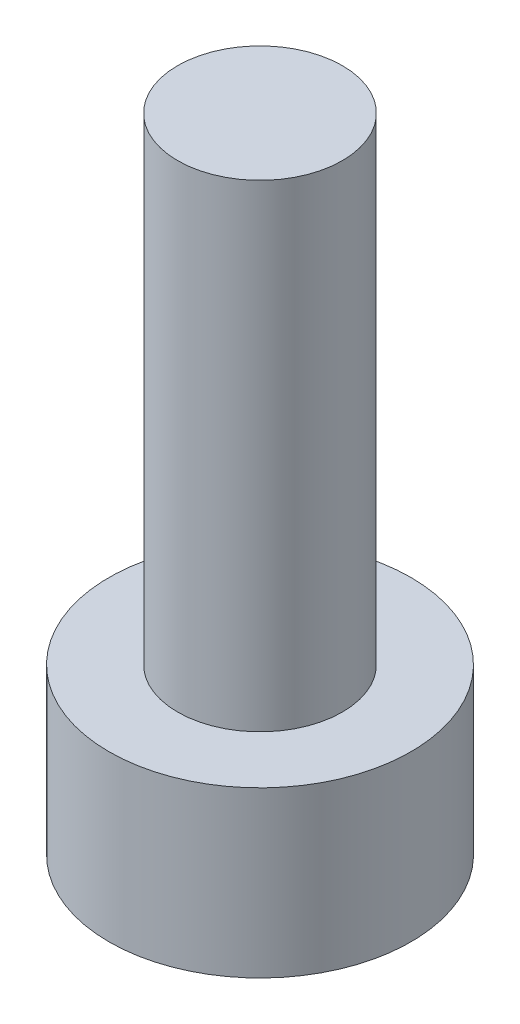
ISO-10303-21;
HEADER;
FILE_DESCRIPTION(('STEP AP214'),'2;1');
FILE_NAME('part.step','',(''),(''),'','','');
FILE_SCHEMA(('AUTOMOTIVE_DESIGN { 1 0 10303 214 1 1 1 1 }'));
ENDSEC;
DATA;
#1=APPLICATION_CONTEXT('core data for automotive mechanical design processes');
#2=APPLICATION_PROTOCOL_DEFINITION('international standard','automotive_design',2000,#1);
#3=PRODUCT_CONTEXT('',#1,'mechanical');
#4=PRODUCT('Part','Part','',(#3));
#5=PRODUCT_RELATED_PRODUCT_CATEGORY('part','',(#4));
#6=PRODUCT_DEFINITION_FORMATION('','',#4);
#7=PRODUCT_DEFINITION_CONTEXT('part definition',#1,'design');
#8=PRODUCT_DEFINITION('design','',#6,#7);
#9=PRODUCT_DEFINITION_SHAPE('','',#8);
#10=(LENGTH_UNIT() NAMED_UNIT(*) SI_UNIT(.MILLI.,.METRE.));
#11=(NAMED_UNIT(*) PLANE_ANGLE_UNIT() SI_UNIT($,.RADIAN.));
#12=(NAMED_UNIT(*) SI_UNIT($,.STERADIAN.) SOLID_ANGLE_UNIT());
#13=UNCERTAINTY_MEASURE_WITH_UNIT(LENGTH_MEASURE(1.E-05),#10,'distance_accuracy_value','');
#14=(GEOMETRIC_REPRESENTATION_CONTEXT(3) GLOBAL_UNCERTAINTY_ASSIGNED_CONTEXT((#13)) GLOBAL_UNIT_ASSIGNED_CONTEXT((#10,
#11,#12)) REPRESENTATION_CONTEXT('',''));
#15=CARTESIAN_POINT('',(0.,0.,0.));
#16=DIRECTION('',(0.,0.,1.));
#17=DIRECTION('',(1.,0.,0.));
#18=AXIS2_PLACEMENT_3D('',#15,#16,#17);
#19=CARTESIAN_POINT('',(0.,3.,0.));
#20=DIRECTION('',(0.,-1.,0.));
#21=DIRECTION('',(0.,0.,-1.));
#22=AXIS2_PLACEMENT_3D('',#19,#20,#21);
#23=CYLINDRICAL_SURFACE('',#22,2.75);
#24=CARTESIAN_POINT('',(0.,3.,0.));
#25=DIRECTION('',(0.,1.,0.));
#26=DIRECTION('',(0.,0.,1.));
#27=AXIS2_PLACEMENT_3D('',#24,#25,#26);
#28=CIRCLE('',#27,2.75);
#29=CARTESIAN_POINT('',(0.,3.,2.75));
#30=VERTEX_POINT('',#29);
#31=EDGE_CURVE('E44',#30,#30,#28,.T.);
#32=ORIENTED_EDGE('',*,*,#31,.F.);
#33=EDGE_LOOP('',(#32));
#34=FACE_BOUND('',#33,.T.);
#35=CARTESIAN_POINT('',(0.,0.,0.));
#36=DIRECTION('',(0.,1.,0.));
#37=DIRECTION('',(0.,0.,1.));
#38=AXIS2_PLACEMENT_3D('',#35,#36,#37);
#39=CIRCLE('',#38,2.75);
#40=CARTESIAN_POINT('',(0.,0.,2.75));
#41=VERTEX_POINT('',#40);
#42=EDGE_CURVE('E40',#41,#41,#39,.T.);
#43=ORIENTED_EDGE('',*,*,#42,.T.);
#44=EDGE_LOOP('',(#43));
#45=FACE_BOUND('',#44,.T.);
#46=ADVANCED_FACE('F37',(#34,#45),#23,.T.);
#47=CARTESIAN_POINT('',(0.,3.,0.));
#48=DIRECTION('',(0.,1.,0.));
#49=DIRECTION('',(0.,0.,1.));
#50=AXIS2_PLACEMENT_3D('',#47,#48,#49);
#51=PLANE('',#50);
#52=CARTESIAN_POINT('',(0.,3.,0.));
#53=DIRECTION('',(0.,1.,0.));
#54=DIRECTION('',(0.,0.,1.));
#55=AXIS2_PLACEMENT_3D('',#52,#53,#54);
#56=CIRCLE('',#55,1.5);
#57=CARTESIAN_POINT('',(0.,3.,1.5));
#58=VERTEX_POINT('',#57);
#59=EDGE_CURVE('E10',#58,#58,#56,.T.);
#60=ORIENTED_EDGE('',*,*,#59,.F.);
#61=EDGE_LOOP('',(#60));
#62=FACE_BOUND('',#61,.T.);
#63=ORIENTED_EDGE('',*,*,#31,.T.);
#64=EDGE_LOOP('',(#63));
#65=FACE_BOUND('',#64,.T.);
#66=ADVANCED_FACE('F61',(#62,#65),#51,.T.);
#67=CARTESIAN_POINT('',(0.,0.,0.));
#68=DIRECTION('',(0.,1.,0.));
#69=DIRECTION('',(0.,0.,1.));
#70=AXIS2_PLACEMENT_3D('',#67,#68,#69);
#71=PLANE('',#70);
#72=ORIENTED_EDGE('',*,*,#42,.F.);
#73=EDGE_LOOP('',(#72));
#74=FACE_BOUND('',#73,.T.);
#75=ADVANCED_FACE('F58',(#74),#71,.F.);
#76=CARTESIAN_POINT('',(0.,11.7,0.));
#77=DIRECTION('',(0.,-1.,0.));
#78=DIRECTION('',(0.,0.,-1.));
#79=AXIS2_PLACEMENT_3D('',#76,#77,#78);
#80=CYLINDRICAL_SURFACE('',#79,1.5);
#81=CARTESIAN_POINT('',(0.,11.7,0.));
#82=DIRECTION('',(0.,1.,0.));
#83=DIRECTION('',(0.,0.,1.));
#84=AXIS2_PLACEMENT_3D('',#81,#82,#83);
#85=CIRCLE('',#84,1.5);
#86=CARTESIAN_POINT('',(0.,11.7,1.5));
#87=VERTEX_POINT('',#86);
#88=EDGE_CURVE('E50',#87,#87,#85,.T.);
#89=ORIENTED_EDGE('',*,*,#88,.F.);
#90=EDGE_LOOP('',(#89));
#91=FACE_BOUND('',#90,.T.);
#92=ORIENTED_EDGE('',*,*,#59,.T.);
#93=EDGE_LOOP('',(#92));
#94=FACE_BOUND('',#93,.T.);
#95=ADVANCED_FACE('F60',(#91,#94),#80,.T.);
#96=CARTESIAN_POINT('',(0.,11.7,0.));
#97=DIRECTION('',(0.,1.,0.));
#98=DIRECTION('',(0.,0.,1.));
#99=AXIS2_PLACEMENT_3D('',#96,#97,#98);
#100=PLANE('',#99);
#101=ORIENTED_EDGE('',*,*,#88,.T.);
#102=EDGE_LOOP('',(#101));
#103=FACE_BOUND('',#102,.T.);
#104=ADVANCED_FACE('F67',(#103),#100,.T.);
#105=CLOSED_SHELL('',(#46,#66,#75,#95,#104));
#106=MANIFOLD_SOLID_BREP('B2',#105);
#107=ADVANCED_BREP_SHAPE_REPRESENTATION('',(#18,#106),#14);
#108=SHAPE_DEFINITION_REPRESENTATION(#9,#107);
ENDSEC;
END-ISO-10303-21;
